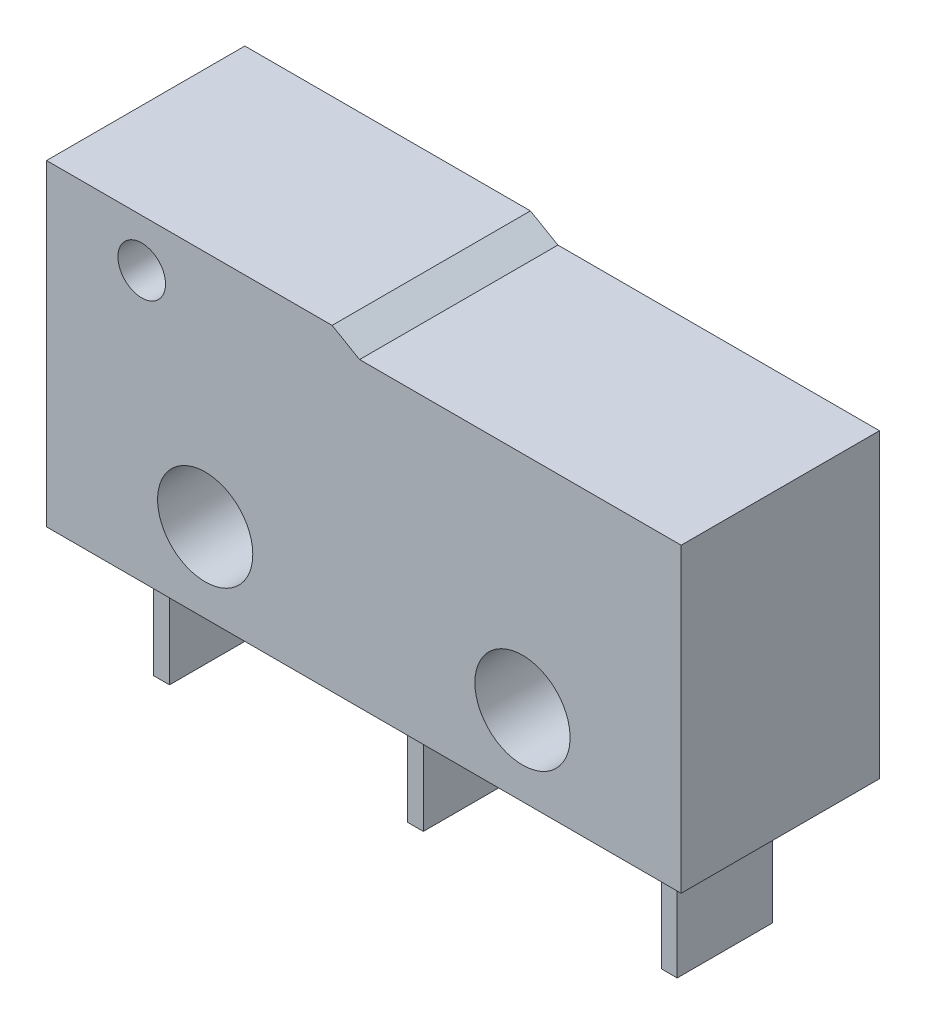
ISO-10303-21;
HEADER;
FILE_DESCRIPTION(('STEP AP214'),'2;1');
FILE_NAME('part.step','',(''),(''),'','','');
FILE_SCHEMA(('AUTOMOTIVE_DESIGN { 1 0 10303 214 1 1 1 1 }'));
ENDSEC;
DATA;
#1=APPLICATION_CONTEXT('core data for automotive mechanical design processes');
#2=APPLICATION_PROTOCOL_DEFINITION('international standard','automotive_design',2000,#1);
#3=PRODUCT_CONTEXT('',#1,'mechanical');
#4=PRODUCT('Part','Part','',(#3));
#5=PRODUCT_RELATED_PRODUCT_CATEGORY('part','',(#4));
#6=PRODUCT_DEFINITION_FORMATION('','',#4);
#7=PRODUCT_DEFINITION_CONTEXT('part definition',#1,'design');
#8=PRODUCT_DEFINITION('design','',#6,#7);
#9=PRODUCT_DEFINITION_SHAPE('','',#8);
#10=(LENGTH_UNIT() NAMED_UNIT(*) SI_UNIT(.MILLI.,.METRE.));
#11=(NAMED_UNIT(*) PLANE_ANGLE_UNIT() SI_UNIT($,.RADIAN.));
#12=(NAMED_UNIT(*) SI_UNIT($,.STERADIAN.) SOLID_ANGLE_UNIT());
#13=UNCERTAINTY_MEASURE_WITH_UNIT(LENGTH_MEASURE(1.E-05),#10,'distance_accuracy_value','');
#14=(GEOMETRIC_REPRESENTATION_CONTEXT(3) GLOBAL_UNCERTAINTY_ASSIGNED_CONTEXT((#13)) GLOBAL_UNIT_ASSIGNED_CONTEXT((#10,
#11,#12)) REPRESENTATION_CONTEXT('',''));
#15=CARTESIAN_POINT('',(0.,0.,0.));
#16=DIRECTION('',(0.,0.,1.));
#17=DIRECTION('',(1.,0.,0.));
#18=AXIS2_PLACEMENT_3D('',#15,#16,#17);
#19=CARTESIAN_POINT('',(10.,0.,3.125));
#20=DIRECTION('',(0.,1.,0.));
#21=DIRECTION('',(0.,0.,1.));
#22=AXIS2_PLACEMENT_3D('',#19,#20,#21);
#23=PLANE('',#22);
#24=DIRECTION('',(0.,0.,-1.));
#25=VECTOR('',#24,1.);
#26=CARTESIAN_POINT('',(-8.25,0.,-1.5));
#27=LINE('',#26,#25);
#28=CARTESIAN_POINT('',(-8.25,0.,1.5));
#29=VERTEX_POINT('',#28);
#30=CARTESIAN_POINT('',(-8.25,0.,-1.5));
#31=VERTEX_POINT('',#30);
#32=EDGE_CURVE('E178',#29,#31,#27,.T.);
#33=ORIENTED_EDGE('',*,*,#32,.F.);
#34=DIRECTION('',(-1.,0.,0.));
#35=VECTOR('',#34,1.);
#36=CARTESIAN_POINT('',(-7.75,0.,1.5));
#37=LINE('',#36,#35);
#38=CARTESIAN_POINT('',(-7.75,0.,1.5));
#39=VERTEX_POINT('',#38);
#40=EDGE_CURVE('E191',#39,#29,#37,.T.);
#41=ORIENTED_EDGE('',*,*,#40,.F.);
#42=DIRECTION('',(0.,0.,1.));
#43=VECTOR('',#42,1.);
#44=CARTESIAN_POINT('',(-7.75,0.,-1.5));
#45=LINE('',#44,#43);
#46=CARTESIAN_POINT('',(-7.75,0.,-1.5));
#47=VERTEX_POINT('',#46);
#48=EDGE_CURVE('E200',#47,#39,#45,.T.);
#49=ORIENTED_EDGE('',*,*,#48,.F.);
#50=DIRECTION('',(1.,0.,0.));
#51=VECTOR('',#50,1.);
#52=CARTESIAN_POINT('',(-7.75,0.,-1.5));
#53=LINE('',#52,#51);
#54=EDGE_CURVE('E181',#31,#47,#53,.T.);
#55=ORIENTED_EDGE('',*,*,#54,.F.);
#56=EDGE_LOOP('',(#33,#41,#49,#55));
#57=FACE_BOUND('',#56,.T.);
#58=DIRECTION('',(1.,0.,0.));
#59=VECTOR('',#58,1.);
#60=CARTESIAN_POINT('',(10.,0.,-3.125));
#61=LINE('',#60,#59);
#62=CARTESIAN_POINT('',(-10.,0.,-3.125));
#63=VERTEX_POINT('',#62);
#64=CARTESIAN_POINT('',(10.,0.,-3.125));
#65=VERTEX_POINT('',#64);
#66=EDGE_CURVE('E287',#63,#65,#61,.T.);
#67=ORIENTED_EDGE('',*,*,#66,.T.);
#68=DIRECTION('',(0.,0.,-1.));
#69=VECTOR('',#68,1.);
#70=CARTESIAN_POINT('',(10.,0.,3.125));
#71=LINE('',#70,#69);
#72=CARTESIAN_POINT('',(10.,0.,3.125));
#73=VERTEX_POINT('',#72);
#74=EDGE_CURVE('E302',#73,#65,#71,.T.);
#75=ORIENTED_EDGE('',*,*,#74,.F.);
#76=DIRECTION('',(1.,0.,0.));
#77=VECTOR('',#76,1.);
#78=CARTESIAN_POINT('',(10.,0.,3.125));
#79=LINE('',#78,#77);
#80=CARTESIAN_POINT('',(-10.,0.,3.125));
#81=VERTEX_POINT('',#80);
#82=EDGE_CURVE('E274',#81,#73,#79,.T.);
#83=ORIENTED_EDGE('',*,*,#82,.F.);
#84=DIRECTION('',(0.,0.,-1.));
#85=VECTOR('',#84,1.);
#86=CARTESIAN_POINT('',(-10.,0.,3.125));
#87=LINE('',#86,#85);
#88=EDGE_CURVE('E40',#81,#63,#87,.T.);
#89=ORIENTED_EDGE('',*,*,#88,.T.);
#90=EDGE_LOOP('',(#67,#75,#83,#89));
#91=FACE_BOUND('',#90,.T.);
#92=DIRECTION('',(0.,0.,-1.));
#93=VECTOR('',#92,1.);
#94=CARTESIAN_POINT('',(-0.25,0.,-1.5));
#95=LINE('',#94,#93);
#96=CARTESIAN_POINT('',(-0.25,0.,1.5));
#97=VERTEX_POINT('',#96);
#98=CARTESIAN_POINT('',(-0.25,0.,-1.5));
#99=VERTEX_POINT('',#98);
#100=EDGE_CURVE('E216',#97,#99,#95,.T.);
#101=ORIENTED_EDGE('',*,*,#100,.F.);
#102=DIRECTION('',(-1.,0.,0.));
#103=VECTOR('',#102,1.);
#104=CARTESIAN_POINT('',(0.25,0.,1.5));
#105=LINE('',#104,#103);
#106=CARTESIAN_POINT('',(0.25,0.,1.5));
#107=VERTEX_POINT('',#106);
#108=EDGE_CURVE('E221',#107,#97,#105,.T.);
#109=ORIENTED_EDGE('',*,*,#108,.F.);
#110=DIRECTION('',(0.,0.,1.));
#111=VECTOR('',#110,1.);
#112=CARTESIAN_POINT('',(0.25,0.,-1.5));
#113=LINE('',#112,#111);
#114=CARTESIAN_POINT('',(0.25,0.,-1.5));
#115=VERTEX_POINT('',#114);
#116=EDGE_CURVE('E233',#115,#107,#113,.T.);
#117=ORIENTED_EDGE('',*,*,#116,.F.);
#118=DIRECTION('',(1.,0.,0.));
#119=VECTOR('',#118,1.);
#120=CARTESIAN_POINT('',(0.25,0.,-1.5));
#121=LINE('',#120,#119);
#122=EDGE_CURVE('E230',#99,#115,#121,.T.);
#123=ORIENTED_EDGE('',*,*,#122,.F.);
#124=EDGE_LOOP('',(#101,#109,#117,#123));
#125=FACE_BOUND('',#124,.T.);
#126=DIRECTION('',(0.,0.,-1.));
#127=VECTOR('',#126,1.);
#128=CARTESIAN_POINT('',(7.75,0.,-1.5));
#129=LINE('',#128,#127);
#130=CARTESIAN_POINT('',(7.75,0.,1.5));
#131=VERTEX_POINT('',#130);
#132=CARTESIAN_POINT('',(7.75,0.,-1.5));
#133=VERTEX_POINT('',#132);
#134=EDGE_CURVE('E177',#131,#133,#129,.T.);
#135=ORIENTED_EDGE('',*,*,#134,.F.);
#136=DIRECTION('',(-1.,0.,0.));
#137=VECTOR('',#136,1.);
#138=CARTESIAN_POINT('',(7.75,0.,1.5));
#139=LINE('',#138,#137);
#140=CARTESIAN_POINT('',(8.25,0.,1.5));
#141=VERTEX_POINT('',#140);
#142=EDGE_CURVE('E174',#141,#131,#139,.T.);
#143=ORIENTED_EDGE('',*,*,#142,.F.);
#144=DIRECTION('',(0.,0.,1.));
#145=VECTOR('',#144,1.);
#146=CARTESIAN_POINT('',(8.25,0.,-1.5));
#147=LINE('',#146,#145);
#148=CARTESIAN_POINT('',(8.25,0.,-1.5));
#149=VERTEX_POINT('',#148);
#150=EDGE_CURVE('E52',#149,#141,#147,.T.);
#151=ORIENTED_EDGE('',*,*,#150,.F.);
#152=DIRECTION('',(1.,0.,0.));
#153=VECTOR('',#152,1.);
#154=CARTESIAN_POINT('',(7.75,0.,-1.5));
#155=LINE('',#154,#153);
#156=EDGE_CURVE('E47',#133,#149,#155,.T.);
#157=ORIENTED_EDGE('',*,*,#156,.F.);
#158=EDGE_LOOP('',(#135,#143,#151,#157));
#159=FACE_BOUND('',#158,.T.);
#160=ADVANCED_FACE('F32',(#57,#91,#125,#159),#23,.F.);
#161=CARTESIAN_POINT('',(0.,0.,3.125));
#162=DIRECTION('',(0.,0.,-1.));
#163=DIRECTION('',(-1.,0.,0.));
#164=AXIS2_PLACEMENT_3D('',#161,#162,#163);
#165=PLANE('',#164);
#166=DIRECTION('',(-1.,0.,0.));
#167=VECTOR('',#166,1.);
#168=CARTESIAN_POINT('',(-10.,10.,3.125));
#169=LINE('',#168,#167);
#170=CARTESIAN_POINT('',(-1.,10.,3.125));
#171=VERTEX_POINT('',#170);
#172=CARTESIAN_POINT('',(-10.,10.,3.125));
#173=VERTEX_POINT('',#172);
#174=EDGE_CURVE('E268',#171,#173,#169,.T.);
#175=ORIENTED_EDGE('',*,*,#174,.T.);
#176=DIRECTION('',(0.,-1.,0.));
#177=VECTOR('',#176,1.);
#178=CARTESIAN_POINT('',(-10.,0.,3.125));
#179=LINE('',#178,#177);
#180=EDGE_CURVE('E271',#173,#81,#179,.T.);
#181=ORIENTED_EDGE('',*,*,#180,.T.);
#182=ORIENTED_EDGE('',*,*,#82,.T.);
#183=DIRECTION('',(0.,1.,0.));
#184=VECTOR('',#183,1.);
#185=CARTESIAN_POINT('',(10.,9.5,3.125));
#186=LINE('',#185,#184);
#187=CARTESIAN_POINT('',(10.,9.5,3.125));
#188=VERTEX_POINT('',#187);
#189=EDGE_CURVE('E276',#73,#188,#186,.T.);
#190=ORIENTED_EDGE('',*,*,#189,.T.);
#191=DIRECTION('',(-1.,0.,0.));
#192=VECTOR('',#191,1.);
#193=CARTESIAN_POINT('',(-0.133974596215564,9.5,3.125));
#194=LINE('',#193,#192);
#195=CARTESIAN_POINT('',(-0.133974596215564,9.5,3.125));
#196=VERTEX_POINT('',#195);
#197=EDGE_CURVE('E278',#188,#196,#194,.T.);
#198=ORIENTED_EDGE('',*,*,#197,.T.);
#199=DIRECTION('',(-0.866025403784438,0.500000000000001,0.));
#200=VECTOR('',#199,1.);
#201=CARTESIAN_POINT('',(-1.,10.,3.125));
#202=LINE('',#201,#200);
#203=EDGE_CURVE('E280',#196,#171,#202,.T.);
#204=ORIENTED_EDGE('',*,*,#203,.T.);
#205=EDGE_LOOP('',(#175,#181,#182,#190,#198,#204));
#206=FACE_BOUND('',#205,.T.);
#207=CARTESIAN_POINT('',(-5.,2.5,3.125));
#208=DIRECTION('',(0.,0.,1.));
#209=DIRECTION('',(1.,0.,0.));
#210=AXIS2_PLACEMENT_3D('',#207,#208,#209);
#211=CIRCLE('',#210,1.5);
#212=CARTESIAN_POINT('',(-3.5,2.5,3.125));
#213=VERTEX_POINT('',#212);
#214=EDGE_CURVE('E262',#213,#213,#211,.T.);
#215=ORIENTED_EDGE('',*,*,#214,.F.);
#216=EDGE_LOOP('',(#215));
#217=FACE_BOUND('',#216,.T.);
#218=CARTESIAN_POINT('',(5.,2.5,3.125));
#219=DIRECTION('',(0.,0.,1.));
#220=DIRECTION('',(-1.,0.,0.));
#221=AXIS2_PLACEMENT_3D('',#218,#219,#220);
#222=CIRCLE('',#221,1.5);
#223=CARTESIAN_POINT('',(3.5,2.5,3.125));
#224=VERTEX_POINT('',#223);
#225=EDGE_CURVE('E256',#224,#224,#222,.T.);
#226=ORIENTED_EDGE('',*,*,#225,.F.);
#227=EDGE_LOOP('',(#226));
#228=FACE_BOUND('',#227,.T.);
#229=CARTESIAN_POINT('',(-7.,8.5,3.125));
#230=DIRECTION('',(0.,0.,1.));
#231=DIRECTION('',(1.,0.,0.));
#232=AXIS2_PLACEMENT_3D('',#229,#230,#231);
#233=CIRCLE('',#232,0.75);
#234=CARTESIAN_POINT('',(-6.25,8.5,3.125));
#235=VERTEX_POINT('',#234);
#236=EDGE_CURVE('E250',#235,#235,#233,.T.);
#237=ORIENTED_EDGE('',*,*,#236,.F.);
#238=EDGE_LOOP('',(#237));
#239=FACE_BOUND('',#238,.T.);
#240=ADVANCED_FACE('F329',(#206,#217,#228,#239),#165,.F.);
#241=CARTESIAN_POINT('',(0.,0.,-3.125));
#242=DIRECTION('',(0.,0.,-1.));
#243=DIRECTION('',(-1.,0.,0.));
#244=AXIS2_PLACEMENT_3D('',#241,#242,#243);
#245=PLANE('',#244);
#246=CARTESIAN_POINT('',(5.,2.5,-3.125));
#247=DIRECTION('',(0.,0.,1.));
#248=DIRECTION('',(-1.,0.,0.));
#249=AXIS2_PLACEMENT_3D('',#246,#247,#248);
#250=CIRCLE('',#249,1.5);
#251=CARTESIAN_POINT('',(3.5,2.5,-3.125));
#252=VERTEX_POINT('',#251);
#253=EDGE_CURVE('E253',#252,#252,#250,.T.);
#254=ORIENTED_EDGE('',*,*,#253,.T.);
#255=EDGE_LOOP('',(#254));
#256=FACE_BOUND('',#255,.T.);
#257=DIRECTION('',(-1.,0.,0.));
#258=VECTOR('',#257,1.);
#259=CARTESIAN_POINT('',(-10.,10.,-3.125));
#260=LINE('',#259,#258);
#261=CARTESIAN_POINT('',(-1.,10.,-3.125));
#262=VERTEX_POINT('',#261);
#263=CARTESIAN_POINT('',(-10.,10.,-3.125));
#264=VERTEX_POINT('',#263);
#265=EDGE_CURVE('E265',#262,#264,#260,.T.);
#266=ORIENTED_EDGE('',*,*,#265,.F.);
#267=DIRECTION('',(-0.866025403784438,0.500000000000001,0.));
#268=VECTOR('',#267,1.);
#269=CARTESIAN_POINT('',(-1.,10.,-3.125));
#270=LINE('',#269,#268);
#271=CARTESIAN_POINT('',(-0.133974596215564,9.5,-3.125));
#272=VERTEX_POINT('',#271);
#273=EDGE_CURVE('E272',#272,#262,#270,.T.);
#274=ORIENTED_EDGE('',*,*,#273,.F.);
#275=DIRECTION('',(-1.,0.,0.));
#276=VECTOR('',#275,1.);
#277=CARTESIAN_POINT('',(-0.133974596215564,9.5,-3.125));
#278=LINE('',#277,#276);
#279=CARTESIAN_POINT('',(10.,9.5,-3.125));
#280=VERTEX_POINT('',#279);
#281=EDGE_CURVE('E291',#280,#272,#278,.T.);
#282=ORIENTED_EDGE('',*,*,#281,.F.);
#283=DIRECTION('',(0.,1.,0.));
#284=VECTOR('',#283,1.);
#285=CARTESIAN_POINT('',(10.,9.5,-3.125));
#286=LINE('',#285,#284);
#287=EDGE_CURVE('E289',#65,#280,#286,.T.);
#288=ORIENTED_EDGE('',*,*,#287,.F.);
#289=ORIENTED_EDGE('',*,*,#66,.F.);
#290=DIRECTION('',(0.,-1.,0.));
#291=VECTOR('',#290,1.);
#292=CARTESIAN_POINT('',(-10.,0.,-3.125));
#293=LINE('',#292,#291);
#294=EDGE_CURVE('E285',#264,#63,#293,.T.);
#295=ORIENTED_EDGE('',*,*,#294,.F.);
#296=EDGE_LOOP('',(#266,#274,#282,#288,#289,#295));
#297=FACE_BOUND('',#296,.T.);
#298=CARTESIAN_POINT('',(-5.,2.5,-3.125));
#299=DIRECTION('',(0.,0.,1.));
#300=DIRECTION('',(1.,0.,0.));
#301=AXIS2_PLACEMENT_3D('',#298,#299,#300);
#302=CIRCLE('',#301,1.5);
#303=CARTESIAN_POINT('',(-3.5,2.5,-3.125));
#304=VERTEX_POINT('',#303);
#305=EDGE_CURVE('E259',#304,#304,#302,.T.);
#306=ORIENTED_EDGE('',*,*,#305,.T.);
#307=EDGE_LOOP('',(#306));
#308=FACE_BOUND('',#307,.T.);
#309=CARTESIAN_POINT('',(-7.,8.5,-3.125));
#310=DIRECTION('',(0.,0.,1.));
#311=DIRECTION('',(1.,0.,0.));
#312=AXIS2_PLACEMENT_3D('',#309,#310,#311);
#313=CIRCLE('',#312,0.75);
#314=CARTESIAN_POINT('',(-6.25,8.5,-3.125));
#315=VERTEX_POINT('',#314);
#316=EDGE_CURVE('E249',#315,#315,#313,.T.);
#317=ORIENTED_EDGE('',*,*,#316,.T.);
#318=EDGE_LOOP('',(#317));
#319=FACE_BOUND('',#318,.T.);
#320=ADVANCED_FACE('F315',(#256,#297,#308,#319),#245,.T.);
#321=CARTESIAN_POINT('',(-10.,10.,3.125));
#322=DIRECTION('',(0.,-1.,0.));
#323=DIRECTION('',(0.,0.,-1.));
#324=AXIS2_PLACEMENT_3D('',#321,#322,#323);
#325=PLANE('',#324);
#326=ORIENTED_EDGE('',*,*,#265,.T.);
#327=DIRECTION('',(0.,0.,-1.));
#328=VECTOR('',#327,1.);
#329=CARTESIAN_POINT('',(-10.,10.,3.125));
#330=LINE('',#329,#328);
#331=EDGE_CURVE('E11',#173,#264,#330,.T.);
#332=ORIENTED_EDGE('',*,*,#331,.F.);
#333=ORIENTED_EDGE('',*,*,#174,.F.);
#334=DIRECTION('',(0.,0.,-1.));
#335=VECTOR('',#334,1.);
#336=CARTESIAN_POINT('',(-1.,10.,3.125));
#337=LINE('',#336,#335);
#338=EDGE_CURVE('E282',#171,#262,#337,.T.);
#339=ORIENTED_EDGE('',*,*,#338,.T.);
#340=EDGE_LOOP('',(#326,#332,#333,#339));
#341=FACE_BOUND('',#340,.T.);
#342=ADVANCED_FACE('F34',(#341),#325,.F.);
#343=CARTESIAN_POINT('',(-10.,0.,3.125));
#344=DIRECTION('',(1.,0.,0.));
#345=DIRECTION('',(0.,0.,-1.));
#346=AXIS2_PLACEMENT_3D('',#343,#344,#345);
#347=PLANE('',#346);
#348=ORIENTED_EDGE('',*,*,#294,.T.);
#349=ORIENTED_EDGE('',*,*,#88,.F.);
#350=ORIENTED_EDGE('',*,*,#180,.F.);
#351=ORIENTED_EDGE('',*,*,#331,.T.);
#352=EDGE_LOOP('',(#348,#349,#350,#351));
#353=FACE_BOUND('',#352,.T.);
#354=ADVANCED_FACE('F334',(#353),#347,.F.);
#355=CARTESIAN_POINT('',(10.,9.5,3.125));
#356=DIRECTION('',(-1.,0.,0.));
#357=DIRECTION('',(0.,0.,1.));
#358=AXIS2_PLACEMENT_3D('',#355,#356,#357);
#359=PLANE('',#358);
#360=ORIENTED_EDGE('',*,*,#287,.T.);
#361=DIRECTION('',(0.,0.,-1.));
#362=VECTOR('',#361,1.);
#363=CARTESIAN_POINT('',(10.,9.5,3.125));
#364=LINE('',#363,#362);
#365=EDGE_CURVE('E299',#188,#280,#364,.T.);
#366=ORIENTED_EDGE('',*,*,#365,.F.);
#367=ORIENTED_EDGE('',*,*,#189,.F.);
#368=ORIENTED_EDGE('',*,*,#74,.T.);
#369=EDGE_LOOP('',(#360,#366,#367,#368));
#370=FACE_BOUND('',#369,.T.);
#371=ADVANCED_FACE('F321',(#370),#359,.F.);
#372=CARTESIAN_POINT('',(-0.133974596215564,9.5,3.125));
#373=DIRECTION('',(0.,-1.,0.));
#374=DIRECTION('',(0.,0.,-1.));
#375=AXIS2_PLACEMENT_3D('',#372,#373,#374);
#376=PLANE('',#375);
#377=ORIENTED_EDGE('',*,*,#281,.T.);
#378=DIRECTION('',(0.,0.,-1.));
#379=VECTOR('',#378,1.);
#380=CARTESIAN_POINT('',(-0.133974596215564,9.5,3.125));
#381=LINE('',#380,#379);
#382=EDGE_CURVE('E296',#196,#272,#381,.T.);
#383=ORIENTED_EDGE('',*,*,#382,.F.);
#384=ORIENTED_EDGE('',*,*,#197,.F.);
#385=ORIENTED_EDGE('',*,*,#365,.T.);
#386=EDGE_LOOP('',(#377,#383,#384,#385));
#387=FACE_BOUND('',#386,.T.);
#388=ADVANCED_FACE('F325',(#387),#376,.F.);
#389=CARTESIAN_POINT('',(-1.,10.,3.125));
#390=DIRECTION('',(-0.500000000000001,-0.866025403784438,0.));
#391=DIRECTION('',(0.866025403784438,-0.500000000000001,0.));
#392=AXIS2_PLACEMENT_3D('',#389,#390,#391);
#393=PLANE('',#392);
#394=ORIENTED_EDGE('',*,*,#273,.T.);
#395=ORIENTED_EDGE('',*,*,#338,.F.);
#396=ORIENTED_EDGE('',*,*,#203,.F.);
#397=ORIENTED_EDGE('',*,*,#382,.T.);
#398=EDGE_LOOP('',(#394,#395,#396,#397));
#399=FACE_BOUND('',#398,.T.);
#400=ADVANCED_FACE('F337',(#399),#393,.F.);
#401=CARTESIAN_POINT('',(-5.,2.5,3.125));
#402=DIRECTION('',(0.,0.,-1.));
#403=DIRECTION('',(-1.,0.,0.));
#404=AXIS2_PLACEMENT_3D('',#401,#402,#403);
#405=CYLINDRICAL_SURFACE('',#404,1.5);
#406=ORIENTED_EDGE('',*,*,#214,.T.);
#407=EDGE_LOOP('',(#406));
#408=FACE_BOUND('',#407,.T.);
#409=ORIENTED_EDGE('',*,*,#305,.F.);
#410=EDGE_LOOP('',(#409));
#411=FACE_BOUND('',#410,.T.);
#412=ADVANCED_FACE('F339',(#408,#411),#405,.F.);
#413=CARTESIAN_POINT('',(5.,2.5,3.125));
#414=DIRECTION('',(0.,0.,-1.));
#415=DIRECTION('',(-1.,0.,0.));
#416=AXIS2_PLACEMENT_3D('',#413,#414,#415);
#417=CYLINDRICAL_SURFACE('',#416,1.5);
#418=ORIENTED_EDGE('',*,*,#225,.T.);
#419=EDGE_LOOP('',(#418));
#420=FACE_BOUND('',#419,.T.);
#421=ORIENTED_EDGE('',*,*,#253,.F.);
#422=EDGE_LOOP('',(#421));
#423=FACE_BOUND('',#422,.T.);
#424=ADVANCED_FACE('F345',(#420,#423),#417,.F.);
#425=CARTESIAN_POINT('',(-7.,8.5,3.125));
#426=DIRECTION('',(0.,0.,-1.));
#427=DIRECTION('',(-1.,0.,0.));
#428=AXIS2_PLACEMENT_3D('',#425,#426,#427);
#429=CYLINDRICAL_SURFACE('',#428,0.75);
#430=ORIENTED_EDGE('',*,*,#236,.T.);
#431=EDGE_LOOP('',(#430));
#432=FACE_BOUND('',#431,.T.);
#433=ORIENTED_EDGE('',*,*,#316,.F.);
#434=EDGE_LOOP('',(#433));
#435=FACE_BOUND('',#434,.T.);
#436=ADVANCED_FACE('F372',(#432,#435),#429,.F.);
#437=CARTESIAN_POINT('',(-0.25,-4.,-1.5));
#438=DIRECTION('',(1.,0.,0.));
#439=DIRECTION('',(0.,0.,-1.));
#440=AXIS2_PLACEMENT_3D('',#437,#438,#439);
#441=PLANE('',#440);
#442=ORIENTED_EDGE('',*,*,#100,.T.);
#443=DIRECTION('',(0.,1.,0.));
#444=VECTOR('',#443,1.);
#445=CARTESIAN_POINT('',(-0.25,-4.,-1.5));
#446=LINE('',#445,#444);
#447=CARTESIAN_POINT('',(-0.25,-4.,-1.5));
#448=VERTEX_POINT('',#447);
#449=EDGE_CURVE('E246',#448,#99,#446,.T.);
#450=ORIENTED_EDGE('',*,*,#449,.F.);
#451=DIRECTION('',(0.,0.,-1.));
#452=VECTOR('',#451,1.);
#453=CARTESIAN_POINT('',(-0.25,-4.,-1.5));
#454=LINE('',#453,#452);
#455=CARTESIAN_POINT('',(-0.25,-4.,1.5));
#456=VERTEX_POINT('',#455);
#457=EDGE_CURVE('E217',#456,#448,#454,.T.);
#458=ORIENTED_EDGE('',*,*,#457,.F.);
#459=DIRECTION('',(0.,1.,0.));
#460=VECTOR('',#459,1.);
#461=CARTESIAN_POINT('',(-0.25,-4.,1.5));
#462=LINE('',#461,#460);
#463=EDGE_CURVE('E227',#456,#97,#462,.T.);
#464=ORIENTED_EDGE('',*,*,#463,.T.);
#465=EDGE_LOOP('',(#442,#450,#458,#464));
#466=FACE_BOUND('',#465,.T.);
#467=ADVANCED_FACE('F376',(#466),#441,.F.);
#468=CARTESIAN_POINT('',(0.25,-4.,-1.5));
#469=DIRECTION('',(0.,0.,1.));
#470=DIRECTION('',(1.,0.,0.));
#471=AXIS2_PLACEMENT_3D('',#468,#469,#470);
#472=PLANE('',#471);
#473=ORIENTED_EDGE('',*,*,#122,.T.);
#474=DIRECTION('',(0.,1.,0.));
#475=VECTOR('',#474,1.);
#476=CARTESIAN_POINT('',(0.25,-4.,-1.5));
#477=LINE('',#476,#475);
#478=CARTESIAN_POINT('',(0.25,-4.,-1.5));
#479=VERTEX_POINT('',#478);
#480=EDGE_CURVE('E243',#479,#115,#477,.T.);
#481=ORIENTED_EDGE('',*,*,#480,.F.);
#482=DIRECTION('',(1.,0.,0.));
#483=VECTOR('',#482,1.);
#484=CARTESIAN_POINT('',(0.25,-4.,-1.5));
#485=LINE('',#484,#483);
#486=EDGE_CURVE('E220',#448,#479,#485,.T.);
#487=ORIENTED_EDGE('',*,*,#486,.F.);
#488=ORIENTED_EDGE('',*,*,#449,.T.);
#489=EDGE_LOOP('',(#473,#481,#487,#488));
#490=FACE_BOUND('',#489,.T.);
#491=ADVANCED_FACE('F380',(#490),#472,.F.);
#492=CARTESIAN_POINT('',(0.25,-4.,-1.5));
#493=DIRECTION('',(-1.,0.,0.));
#494=DIRECTION('',(0.,0.,1.));
#495=AXIS2_PLACEMENT_3D('',#492,#493,#494);
#496=PLANE('',#495);
#497=ORIENTED_EDGE('',*,*,#116,.T.);
#498=DIRECTION('',(0.,1.,0.));
#499=VECTOR('',#498,1.);
#500=CARTESIAN_POINT('',(0.25,-4.,1.5));
#501=LINE('',#500,#499);
#502=CARTESIAN_POINT('',(0.25,-4.,1.5));
#503=VERTEX_POINT('',#502);
#504=EDGE_CURVE('E240',#503,#107,#501,.T.);
#505=ORIENTED_EDGE('',*,*,#504,.F.);
#506=DIRECTION('',(0.,0.,1.));
#507=VECTOR('',#506,1.);
#508=CARTESIAN_POINT('',(0.25,-4.,-1.5));
#509=LINE('',#508,#507);
#510=EDGE_CURVE('E223',#479,#503,#509,.T.);
#511=ORIENTED_EDGE('',*,*,#510,.F.);
#512=ORIENTED_EDGE('',*,*,#480,.T.);
#513=EDGE_LOOP('',(#497,#505,#511,#512));
#514=FACE_BOUND('',#513,.T.);
#515=ADVANCED_FACE('F384',(#514),#496,.F.);
#516=CARTESIAN_POINT('',(0.25,-4.,1.5));
#517=DIRECTION('',(0.,0.,-1.));
#518=DIRECTION('',(-1.,0.,0.));
#519=AXIS2_PLACEMENT_3D('',#516,#517,#518);
#520=PLANE('',#519);
#521=ORIENTED_EDGE('',*,*,#108,.T.);
#522=ORIENTED_EDGE('',*,*,#463,.F.);
#523=DIRECTION('',(-1.,0.,0.));
#524=VECTOR('',#523,1.);
#525=CARTESIAN_POINT('',(0.25,-4.,1.5));
#526=LINE('',#525,#524);
#527=EDGE_CURVE('E225',#503,#456,#526,.T.);
#528=ORIENTED_EDGE('',*,*,#527,.F.);
#529=ORIENTED_EDGE('',*,*,#504,.T.);
#530=EDGE_LOOP('',(#521,#522,#528,#529));
#531=FACE_BOUND('',#530,.T.);
#532=ADVANCED_FACE('F388',(#531),#520,.F.);
#533=CARTESIAN_POINT('',(0.,-4.,0.));
#534=DIRECTION('',(0.,-1.,0.));
#535=DIRECTION('',(0.,0.,-1.));
#536=AXIS2_PLACEMENT_3D('',#533,#534,#535);
#537=PLANE('',#536);
#538=ORIENTED_EDGE('',*,*,#457,.T.);
#539=ORIENTED_EDGE('',*,*,#486,.T.);
#540=ORIENTED_EDGE('',*,*,#510,.T.);
#541=ORIENTED_EDGE('',*,*,#527,.T.);
#542=EDGE_LOOP('',(#538,#539,#540,#541));
#543=FACE_BOUND('',#542,.T.);
#544=ADVANCED_FACE('F392',(#543),#537,.T.);
#545=CARTESIAN_POINT('',(-8.25,-4.,-1.5));
#546=DIRECTION('',(1.,0.,0.));
#547=DIRECTION('',(0.,0.,-1.));
#548=AXIS2_PLACEMENT_3D('',#545,#546,#547);
#549=PLANE('',#548);
#550=ORIENTED_EDGE('',*,*,#32,.T.);
#551=DIRECTION('',(0.,1.,0.));
#552=VECTOR('',#551,1.);
#553=CARTESIAN_POINT('',(-8.25,-4.,-1.5));
#554=LINE('',#553,#552);
#555=CARTESIAN_POINT('',(-8.25,-4.,-1.5));
#556=VERTEX_POINT('',#555);
#557=EDGE_CURVE('E213',#556,#31,#554,.T.);
#558=ORIENTED_EDGE('',*,*,#557,.F.);
#559=DIRECTION('',(0.,0.,-1.));
#560=VECTOR('',#559,1.);
#561=CARTESIAN_POINT('',(-8.25,-4.,-1.5));
#562=LINE('',#561,#560);
#563=CARTESIAN_POINT('',(-8.25,-4.,1.5));
#564=VERTEX_POINT('',#563);
#565=EDGE_CURVE('E187',#564,#556,#562,.T.);
#566=ORIENTED_EDGE('',*,*,#565,.F.);
#567=DIRECTION('',(0.,1.,0.));
#568=VECTOR('',#567,1.);
#569=CARTESIAN_POINT('',(-8.25,-4.,1.5));
#570=LINE('',#569,#568);
#571=EDGE_CURVE('E196',#564,#29,#570,.T.);
#572=ORIENTED_EDGE('',*,*,#571,.T.);
#573=EDGE_LOOP('',(#550,#558,#566,#572));
#574=FACE_BOUND('',#573,.T.);
#575=ADVANCED_FACE('F396',(#574),#549,.F.);
#576=CARTESIAN_POINT('',(-7.75,-4.,-1.5));
#577=DIRECTION('',(0.,0.,1.));
#578=DIRECTION('',(1.,0.,0.));
#579=AXIS2_PLACEMENT_3D('',#576,#577,#578);
#580=PLANE('',#579);
#581=ORIENTED_EDGE('',*,*,#54,.T.);
#582=DIRECTION('',(0.,1.,0.));
#583=VECTOR('',#582,1.);
#584=CARTESIAN_POINT('',(-7.75,-4.,-1.5));
#585=LINE('',#584,#583);
#586=CARTESIAN_POINT('',(-7.75,-4.,-1.5));
#587=VERTEX_POINT('',#586);
#588=EDGE_CURVE('E210',#587,#47,#585,.T.);
#589=ORIENTED_EDGE('',*,*,#588,.F.);
#590=DIRECTION('',(1.,0.,0.));
#591=VECTOR('',#590,1.);
#592=CARTESIAN_POINT('',(-7.75,-4.,-1.5));
#593=LINE('',#592,#591);
#594=EDGE_CURVE('E190',#556,#587,#593,.T.);
#595=ORIENTED_EDGE('',*,*,#594,.F.);
#596=ORIENTED_EDGE('',*,*,#557,.T.);
#597=EDGE_LOOP('',(#581,#589,#595,#596));
#598=FACE_BOUND('',#597,.T.);
#599=ADVANCED_FACE('F400',(#598),#580,.F.);
#600=CARTESIAN_POINT('',(-7.75,-4.,-1.5));
#601=DIRECTION('',(-1.,0.,0.));
#602=DIRECTION('',(0.,0.,1.));
#603=AXIS2_PLACEMENT_3D('',#600,#601,#602);
#604=PLANE('',#603);
#605=ORIENTED_EDGE('',*,*,#48,.T.);
#606=DIRECTION('',(0.,1.,0.));
#607=VECTOR('',#606,1.);
#608=CARTESIAN_POINT('',(-7.75,-4.,1.5));
#609=LINE('',#608,#607);
#610=CARTESIAN_POINT('',(-7.75,-4.,1.5));
#611=VERTEX_POINT('',#610);
#612=EDGE_CURVE('E207',#611,#39,#609,.T.);
#613=ORIENTED_EDGE('',*,*,#612,.F.);
#614=DIRECTION('',(0.,0.,1.));
#615=VECTOR('',#614,1.);
#616=CARTESIAN_POINT('',(-7.75,-4.,-1.5));
#617=LINE('',#616,#615);
#618=EDGE_CURVE('E193',#587,#611,#617,.T.);
#619=ORIENTED_EDGE('',*,*,#618,.F.);
#620=ORIENTED_EDGE('',*,*,#588,.T.);
#621=EDGE_LOOP('',(#605,#613,#619,#620));
#622=FACE_BOUND('',#621,.T.);
#623=ADVANCED_FACE('F404',(#622),#604,.F.);
#624=CARTESIAN_POINT('',(-7.75,-4.,1.5));
#625=DIRECTION('',(0.,0.,-1.));
#626=DIRECTION('',(-1.,0.,0.));
#627=AXIS2_PLACEMENT_3D('',#624,#625,#626);
#628=PLANE('',#627);
#629=ORIENTED_EDGE('',*,*,#40,.T.);
#630=ORIENTED_EDGE('',*,*,#571,.F.);
#631=DIRECTION('',(-1.,0.,0.));
#632=VECTOR('',#631,1.);
#633=CARTESIAN_POINT('',(-7.75,-4.,1.5));
#634=LINE('',#633,#632);
#635=EDGE_CURVE('E195',#611,#564,#634,.T.);
#636=ORIENTED_EDGE('',*,*,#635,.F.);
#637=ORIENTED_EDGE('',*,*,#612,.T.);
#638=EDGE_LOOP('',(#629,#630,#636,#637));
#639=FACE_BOUND('',#638,.T.);
#640=ADVANCED_FACE('F408',(#639),#628,.F.);
#641=CARTESIAN_POINT('',(0.,-4.,0.));
#642=DIRECTION('',(0.,-1.,0.));
#643=DIRECTION('',(0.,0.,-1.));
#644=AXIS2_PLACEMENT_3D('',#641,#642,#643);
#645=PLANE('',#644);
#646=ORIENTED_EDGE('',*,*,#565,.T.);
#647=ORIENTED_EDGE('',*,*,#594,.T.);
#648=ORIENTED_EDGE('',*,*,#618,.T.);
#649=ORIENTED_EDGE('',*,*,#635,.T.);
#650=EDGE_LOOP('',(#646,#647,#648,#649));
#651=FACE_BOUND('',#650,.T.);
#652=ADVANCED_FACE('F412',(#651),#645,.T.);
#653=CARTESIAN_POINT('',(7.75,-4.,-1.5));
#654=DIRECTION('',(1.,0.,0.));
#655=DIRECTION('',(0.,0.,-1.));
#656=AXIS2_PLACEMENT_3D('',#653,#654,#655);
#657=PLANE('',#656);
#658=ORIENTED_EDGE('',*,*,#134,.T.);
#659=DIRECTION('',(0.,1.,0.));
#660=VECTOR('',#659,1.);
#661=CARTESIAN_POINT('',(7.75,-4.,-1.5));
#662=LINE('',#661,#660);
#663=CARTESIAN_POINT('',(7.75,-4.,-1.5));
#664=VERTEX_POINT('',#663);
#665=EDGE_CURVE('E158',#664,#133,#662,.T.);
#666=ORIENTED_EDGE('',*,*,#665,.F.);
#667=DIRECTION('',(0.,0.,-1.));
#668=VECTOR('',#667,1.);
#669=CARTESIAN_POINT('',(7.75,-4.,-1.5));
#670=LINE('',#669,#668);
#671=CARTESIAN_POINT('',(7.75,-4.,1.5));
#672=VERTEX_POINT('',#671);
#673=EDGE_CURVE('E165',#672,#664,#670,.T.);
#674=ORIENTED_EDGE('',*,*,#673,.F.);
#675=DIRECTION('',(0.,1.,0.));
#676=VECTOR('',#675,1.);
#677=CARTESIAN_POINT('',(7.75,-4.,1.5));
#678=LINE('',#677,#676);
#679=EDGE_CURVE('E578',#672,#131,#678,.T.);
#680=ORIENTED_EDGE('',*,*,#679,.T.);
#681=EDGE_LOOP('',(#658,#666,#674,#680));
#682=FACE_BOUND('',#681,.T.);
#683=ADVANCED_FACE('F176',(#682),#657,.F.);
#684=CARTESIAN_POINT('',(7.75,-4.,-1.5));
#685=DIRECTION('',(0.,0.,1.));
#686=DIRECTION('',(1.,0.,0.));
#687=AXIS2_PLACEMENT_3D('',#684,#685,#686);
#688=PLANE('',#687);
#689=ORIENTED_EDGE('',*,*,#156,.T.);
#690=DIRECTION('',(0.,1.,0.));
#691=VECTOR('',#690,1.);
#692=CARTESIAN_POINT('',(8.25,-4.,-1.5));
#693=LINE('',#692,#691);
#694=CARTESIAN_POINT('',(8.25,-4.,-1.5));
#695=VERTEX_POINT('',#694);
#696=EDGE_CURVE('E161',#695,#149,#693,.T.);
#697=ORIENTED_EDGE('',*,*,#696,.F.);
#698=DIRECTION('',(1.,0.,0.));
#699=VECTOR('',#698,1.);
#700=CARTESIAN_POINT('',(7.75,-4.,-1.5));
#701=LINE('',#700,#699);
#702=EDGE_CURVE('E154',#664,#695,#701,.T.);
#703=ORIENTED_EDGE('',*,*,#702,.F.);
#704=ORIENTED_EDGE('',*,*,#665,.T.);
#705=EDGE_LOOP('',(#689,#697,#703,#704));
#706=FACE_BOUND('',#705,.T.);
#707=ADVANCED_FACE('F156',(#706),#688,.F.);
#708=CARTESIAN_POINT('',(8.25,-4.,-1.5));
#709=DIRECTION('',(-1.,0.,0.));
#710=DIRECTION('',(0.,0.,1.));
#711=AXIS2_PLACEMENT_3D('',#708,#709,#710);
#712=PLANE('',#711);
#713=ORIENTED_EDGE('',*,*,#150,.T.);
#714=DIRECTION('',(0.,1.,0.));
#715=VECTOR('',#714,1.);
#716=CARTESIAN_POINT('',(8.25,-4.,1.5));
#717=LINE('',#716,#715);
#718=CARTESIAN_POINT('',(8.25,-4.,1.5));
#719=VERTEX_POINT('',#718);
#720=EDGE_CURVE('E183',#719,#141,#717,.T.);
#721=ORIENTED_EDGE('',*,*,#720,.F.);
#722=DIRECTION('',(0.,0.,1.));
#723=VECTOR('',#722,1.);
#724=CARTESIAN_POINT('',(8.25,-4.,-1.5));
#725=LINE('',#724,#723);
#726=EDGE_CURVE('E164',#695,#719,#725,.T.);
#727=ORIENTED_EDGE('',*,*,#726,.F.);
#728=ORIENTED_EDGE('',*,*,#696,.T.);
#729=EDGE_LOOP('',(#713,#721,#727,#728));
#730=FACE_BOUND('',#729,.T.);
#731=ADVANCED_FACE('F421',(#730),#712,.F.);
#732=CARTESIAN_POINT('',(7.75,-4.,1.5));
#733=DIRECTION('',(0.,0.,-1.));
#734=DIRECTION('',(-1.,0.,0.));
#735=AXIS2_PLACEMENT_3D('',#732,#733,#734);
#736=PLANE('',#735);
#737=ORIENTED_EDGE('',*,*,#142,.T.);
#738=ORIENTED_EDGE('',*,*,#679,.F.);
#739=DIRECTION('',(-1.,0.,0.));
#740=VECTOR('',#739,1.);
#741=CARTESIAN_POINT('',(7.75,-4.,1.5));
#742=LINE('',#741,#740);
#743=EDGE_CURVE('E170',#719,#672,#742,.T.);
#744=ORIENTED_EDGE('',*,*,#743,.F.);
#745=ORIENTED_EDGE('',*,*,#720,.T.);
#746=EDGE_LOOP('',(#737,#738,#744,#745));
#747=FACE_BOUND('',#746,.T.);
#748=ADVANCED_FACE('F424',(#747),#736,.F.);
#749=CARTESIAN_POINT('',(0.,-4.,0.));
#750=DIRECTION('',(0.,1.,0.));
#751=DIRECTION('',(0.,0.,1.));
#752=AXIS2_PLACEMENT_3D('',#749,#750,#751);
#753=PLANE('',#752);
#754=ORIENTED_EDGE('',*,*,#673,.T.);
#755=ORIENTED_EDGE('',*,*,#702,.T.);
#756=ORIENTED_EDGE('',*,*,#726,.T.);
#757=ORIENTED_EDGE('',*,*,#743,.T.);
#758=EDGE_LOOP('',(#754,#755,#756,#757));
#759=FACE_BOUND('',#758,.T.);
#760=ADVANCED_FACE('F168',(#759),#753,.F.);
#761=CLOSED_SHELL('',(#160,#240,#320,#342,#354,#371,#388,#400,#412,#424,#436,#467,#491,#515,
#532,#544,#575,#599,#623,#640,#652,#683,#707,#731,#748,#760));
#762=MANIFOLD_SOLID_BREP('B2',#761);
#763=ADVANCED_BREP_SHAPE_REPRESENTATION('',(#18,#762),#14);
#764=SHAPE_DEFINITION_REPRESENTATION(#9,#763);
ENDSEC;
END-ISO-10303-21;
